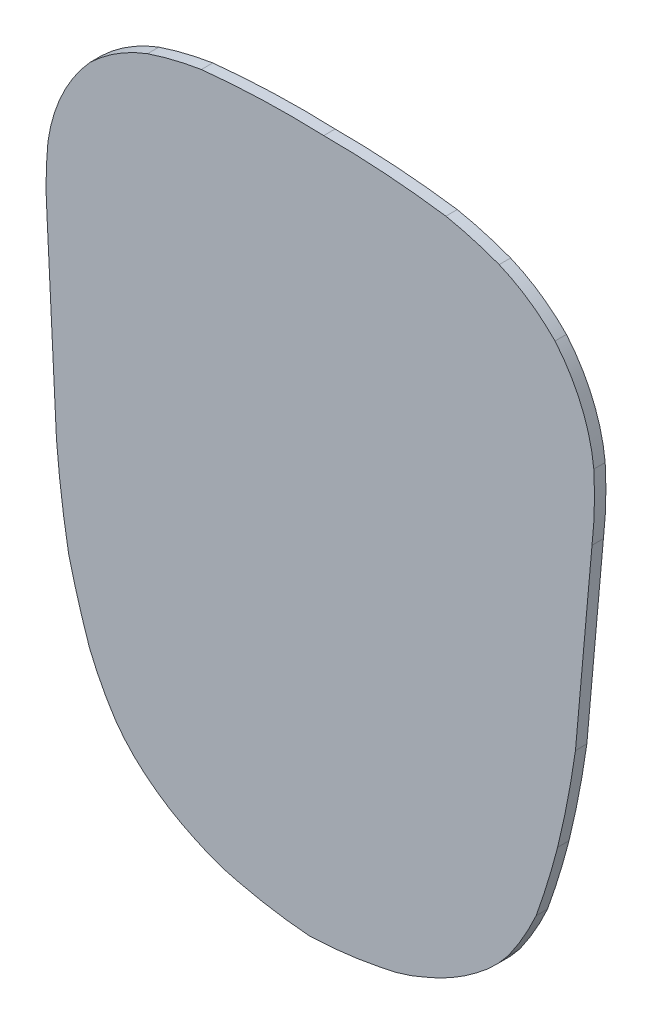
ISO-10303-21;
HEADER;
FILE_DESCRIPTION(('STEP AP214'),'2;1');
FILE_NAME('part.step','',(''),(''),'','','');
FILE_SCHEMA(('AUTOMOTIVE_DESIGN { 1 0 10303 214 1 1 1 1 }'));
ENDSEC;
DATA;
#1=APPLICATION_CONTEXT('core data for automotive mechanical design processes');
#2=APPLICATION_PROTOCOL_DEFINITION('international standard','automotive_design',2000,#1);
#3=PRODUCT_CONTEXT('',#1,'mechanical');
#4=PRODUCT('Part','Part','',(#3));
#5=PRODUCT_RELATED_PRODUCT_CATEGORY('part','',(#4));
#6=PRODUCT_DEFINITION_FORMATION('','',#4);
#7=PRODUCT_DEFINITION_CONTEXT('part definition',#1,'design');
#8=PRODUCT_DEFINITION('design','',#6,#7);
#9=PRODUCT_DEFINITION_SHAPE('','',#8);
#10=(LENGTH_UNIT() NAMED_UNIT(*) SI_UNIT(.MILLI.,.METRE.));
#11=(NAMED_UNIT(*) PLANE_ANGLE_UNIT() SI_UNIT($,.RADIAN.));
#12=(NAMED_UNIT(*) SI_UNIT($,.STERADIAN.) SOLID_ANGLE_UNIT());
#13=UNCERTAINTY_MEASURE_WITH_UNIT(LENGTH_MEASURE(1.E-05),#10,'distance_accuracy_value','');
#14=(GEOMETRIC_REPRESENTATION_CONTEXT(3) GLOBAL_UNCERTAINTY_ASSIGNED_CONTEXT((#13)) GLOBAL_UNIT_ASSIGNED_CONTEXT((#10,
#11,#12)) REPRESENTATION_CONTEXT('',''));
#15=CARTESIAN_POINT('',(0.,0.,0.));
#16=DIRECTION('',(0.,0.,1.));
#17=DIRECTION('',(1.,0.,0.));
#18=AXIS2_PLACEMENT_3D('',#15,#16,#17);
#19=CARTESIAN_POINT('',(-2.87645068487033,-22.2307778413904,43.1510965279302));
#20=DIRECTION('',(0.,0.,1.));
#21=DIRECTION('',(0.0193548335692301,0.999812677663925,0.));
#22=AXIS2_PLACEMENT_3D('',#19,#20,#21);
#23=PLANE('',#22);
#24=CARTESIAN_POINT('',(3.40605421210527,8.0200148488719,43.15109652793));
#25=DIRECTION('',(0.,0.,-1.));
#26=DIRECTION('',(-0.0193548335692301,-0.999812677663925,0.));
#27=AXIS2_PLACEMENT_3D('',#24,#25,#26);
#28=CIRCLE('',#27,7.43643173112);
#29=CARTESIAN_POINT('',(8.74976189327227,13.1916011731872,43.15109652793));
#30=VERTEX_POINT('',#29);
#31=CARTESIAN_POINT('',(6.29473617833653,14.8724621043842,43.1510965279299));
#32=VERTEX_POINT('',#31);
#33=EDGE_CURVE('E362',#30,#32,#28,.F.);
#34=ORIENTED_EDGE('',*,*,#33,.F.);
#35=CARTESIAN_POINT('',(3.11803650286176,8.43130453548574,43.1510965279299));
#36=DIRECTION('',(0.,0.,-1.));
#37=DIRECTION('',(-0.0193548335692301,-0.999812677663925,0.));
#38=AXIS2_PLACEMENT_3D('',#35,#36,#37);
#39=CIRCLE('',#38,7.3740595978);
#40=CARTESIAN_POINT('',(10.4553019723892,9.16702892789541,43.1510965279302));
#41=VERTEX_POINT('',#40);
#42=EDGE_CURVE('E208',#41,#30,#39,.F.);
#43=ORIENTED_EDGE('',*,*,#42,.F.);
#44=CARTESIAN_POINT('',(-6.32552371849111,8.14421174061843,43.1510965279296));
#45=DIRECTION('',(0.,0.,-1.));
#46=DIRECTION('',(-0.0193548335692301,-0.999812677663925,0.));
#47=AXIS2_PLACEMENT_3D('',#44,#45,#46);
#48=CIRCLE('',#47,16.81196793556);
#49=CARTESIAN_POINT('',(10.3766044314371,6.22557130278919,43.1510965279302));
#50=VERTEX_POINT('',#49);
#51=EDGE_CURVE('E35',#50,#41,#48,.F.);
#52=ORIENTED_EDGE('',*,*,#51,.F.);
#53=DIRECTION('',(-0.0886995040357044,-0.996058431008854,0.));
#54=VECTOR('',#53,1.);
#55=CARTESIAN_POINT('',(10.3766044314371,6.22557130278921,43.1510965279302));
#56=LINE('',#55,#54);
#57=CARTESIAN_POINT('',(9.64811099468465,-1.95510611475086,43.1510965279302));
#58=VERTEX_POINT('',#57);
#59=EDGE_CURVE('E207',#50,#58,#56,.T.);
#60=ORIENTED_EDGE('',*,*,#59,.T.);
#61=CARTESIAN_POINT('',(-31.2814474166913,3.80134354731974,43.1510965279289));
#62=DIRECTION('',(0.,0.,-1.));
#63=DIRECTION('',(-0.0193548335692301,-0.999812677663925,0.));
#64=AXIS2_PLACEMENT_3D('',#61,#62,#63);
#65=CIRCLE('',#64,41.33237791928);
#66=CARTESIAN_POINT('',(8.86403234955431,-6.0325732105216,43.1510965279303));
#67=VERTEX_POINT('',#66);
#68=EDGE_CURVE('E218',#67,#58,#65,.F.);
#69=ORIENTED_EDGE('',*,*,#68,.F.);
#70=CARTESIAN_POINT('',(-24.9737606237932,2.68335405814096,43.1510965279291));
#71=DIRECTION('',(0.,0.,-1.));
#72=DIRECTION('',(-0.0193548335692301,-0.999812677663925,0.));
#73=AXIS2_PLACEMENT_3D('',#70,#71,#72);
#74=CIRCLE('',#73,34.94228987144);
#75=CARTESIAN_POINT('',(7.9194767814797,-9.1064107597041,43.1510965279303));
#76=VERTEX_POINT('',#75);
#77=EDGE_CURVE('E302',#76,#67,#74,.F.);
#78=ORIENTED_EDGE('',*,*,#77,.F.);
#79=CARTESIAN_POINT('',(-3.58067037627316,-3.93497982202898,43.1510965279299));
#80=DIRECTION('',(0.,0.,-1.));
#81=DIRECTION('',(-0.0193548335692301,-0.999812677663925,0.));
#82=AXIS2_PLACEMENT_3D('',#79,#80,#81);
#83=CIRCLE('',#82,12.60940452968);
#84=CARTESIAN_POINT('',(6.69776683055133,-11.2391437836662,43.1510965279303));
#85=VERTEX_POINT('',#84);
#86=EDGE_CURVE('E305',#85,#76,#83,.F.);
#87=ORIENTED_EDGE('',*,*,#86,.F.);
#88=CARTESIAN_POINT('',(1.10266886694127,-6.86934474010801,43.15109652793));
#89=DIRECTION('',(0.,0.,-1.));
#90=DIRECTION('',(-0.0193548335692301,-0.999812677663925,0.));
#91=AXIS2_PLACEMENT_3D('',#88,#89,#90);
#92=CIRCLE('',#91,7.09931439672);
#93=CARTESIAN_POINT('',(5.3008399811585,-12.5943446701716,43.1510965279303));
#94=VERTEX_POINT('',#93);
#95=EDGE_CURVE('E308',#94,#85,#92,.F.);
#96=ORIENTED_EDGE('',*,*,#95,.F.);
#97=CARTESIAN_POINT('',(-0.638723059391969,-4.83953730632281,43.15109652793));
#98=DIRECTION('',(0.,0.,-1.));
#99=DIRECTION('',(-0.0193548335692301,-0.999812677663925,0.));
#100=AXIS2_PLACEMENT_3D('',#97,#98,#99);
#101=CIRCLE('',#100,9.76808304444);
#102=CARTESIAN_POINT('',(3.02325465351666,-13.8952187049386,43.1510965279302));
#103=VERTEX_POINT('',#102);
#104=EDGE_CURVE('E311',#103,#94,#101,.F.);
#105=ORIENTED_EDGE('',*,*,#104,.F.);
#106=CARTESIAN_POINT('',(-0.207770559998263,-6.83732878190931,43.15109652793));
#107=DIRECTION('',(0.,0.,-1.));
#108=DIRECTION('',(-0.0193548335692301,-0.999812677663925,0.));
#109=AXIS2_PLACEMENT_3D('',#106,#107,#108);
#110=CIRCLE('',#109,7.76230211316);
#111=CARTESIAN_POINT('',(1.11765382111094,-14.4856347581324,43.1510965279302));
#112=VERTEX_POINT('',#111);
#113=EDGE_CURVE('E314',#112,#103,#110,.F.);
#114=ORIENTED_EDGE('',*,*,#113,.F.);
#115=CARTESIAN_POINT('',(-2.80966912930602,4.75500909683415,43.1510965279298));
#116=DIRECTION('',(0.,0.,-1.));
#117=DIRECTION('',(-0.0193548335692301,-0.999812677663925,0.));
#118=AXIS2_PLACEMENT_3D('',#115,#116,#117);
#119=CIRCLE('',#118,19.6373684976);
#120=CARTESIAN_POINT('',(-2.0152683231092,-14.8662846645274,43.1510965279301));
#121=VERTEX_POINT('',#120);
#122=EDGE_CURVE('E317',#121,#112,#119,.F.);
#123=ORIENTED_EDGE('',*,*,#122,.F.);
#124=CARTESIAN_POINT('',(-0.523207579480698,4.71400533480683,43.1510965279299));
#125=DIRECTION('',(0.,0.,-1.));
#126=DIRECTION('',(-0.0193548335692301,-0.999812677663925,0.));
#127=AXIS2_PLACEMENT_3D('',#124,#125,#126);
#128=CIRCLE('',#127,19.63705684976);
#129=CARTESIAN_POINT('',(-5.17633782189568,-14.3637927736707,43.15109652793));
#130=VERTEX_POINT('',#129);
#131=EDGE_CURVE('E320',#130,#121,#128,.F.);
#132=ORIENTED_EDGE('',*,*,#131,.F.);
#133=CARTESIAN_POINT('',(-3.55589855490564,-6.77251418057686,43.1510965279299));
#134=DIRECTION('',(0.,0.,-1.));
#135=DIRECTION('',(-0.0193548335692301,-0.999812677663925,0.));
#136=AXIS2_PLACEMENT_3D('',#133,#134,#135);
#137=CIRCLE('',#136,7.76230211316);
#138=CARTESIAN_POINT('',(-7.05766041396093,-13.7000677154428,43.1510965279299));
#139=VERTEX_POINT('',#138);
#140=EDGE_CURVE('E323',#139,#130,#137,.F.);
#141=ORIENTED_EDGE('',*,*,#140,.F.);
#142=CARTESIAN_POINT('',(-3.04794957670783,-4.79289839153911,43.1510965279299));
#143=DIRECTION('',(0.,0.,-1.));
#144=DIRECTION('',(-0.0193548335692301,-0.999812677663925,0.));
#145=AXIS2_PLACEMENT_3D('',#142,#143,#144);
#146=CIRCLE('',#145,9.76808304444);
#147=CARTESIAN_POINT('',(-9.28319236302841,-12.3120202657152,43.1510965279298));
#148=VERTEX_POINT('',#147);
#149=EDGE_CURVE('E326',#148,#139,#146,.F.);
#150=ORIENTED_EDGE('',*,*,#149,.F.);
#151=CARTESIAN_POINT('',(-4.76167465689602,-6.83879977530856,43.1510965279299));
#152=DIRECTION('',(0.,0.,-1.));
#153=DIRECTION('',(-0.0193548335692301,-0.999812677663925,0.));
#154=AXIS2_PLACEMENT_3D('',#151,#152,#153);
#155=CIRCLE('',#154,7.09931439672);
#156=CARTESIAN_POINT('',(-10.5813963887555,-10.9046457963967,43.1510965279297));
#157=VERTEX_POINT('',#156);
#158=EDGE_CURVE('E329',#157,#148,#155,.F.);
#159=ORIENTED_EDGE('',*,*,#158,.F.);
#160=CARTESIAN_POINT('',(-0.0279711922389993,-4.00375460651079,43.15109652793));
#161=DIRECTION('',(0.,0.,-1.));
#162=DIRECTION('',(-0.0193548335692301,-0.999812677663925,0.));
#163=AXIS2_PLACEMENT_3D('',#160,#161,#162);
#164=CIRCLE('',#163,12.60940452968);
#165=CARTESIAN_POINT('',(-11.7196490905641,-8.726227530195,43.1510965279297));
#166=VERTEX_POINT('',#165);
#167=EDGE_CURVE('E332',#166,#157,#164,.F.);
#168=ORIENTED_EDGE('',*,*,#167,.F.);
#169=CARTESIAN_POINT('',(21.3074102324665,2.68328490166436,43.1510965279306));
#170=DIRECTION('',(0.,0.,-1.));
#171=DIRECTION('',(-0.0193548335692301,-0.999812677663925,0.));
#172=AXIS2_PLACEMENT_3D('',#169,#170,#171);
#173=CIRCLE('',#172,34.94228987144);
#174=CARTESIAN_POINT('',(-12.6348799299237,-5.61638738053107,43.1510965279296));
#175=VERTEX_POINT('',#174);
#176=EDGE_CURVE('E335',#175,#166,#173,.F.);
#177=ORIENTED_EDGE('',*,*,#176,.F.);
#178=CARTESIAN_POINT('',(28.0310735031442,1.7758853310058,43.1510965279308));
#179=DIRECTION('',(0.,0.,-1.));
#180=DIRECTION('',(-0.0193548335692301,-0.999812677663925,0.));
#181=AXIS2_PLACEMENT_3D('',#178,#179,#180);
#182=CIRCLE('',#181,41.33237791928);
#183=CARTESIAN_POINT('',(-13.1702154109104,-1.51337845938613,43.1510965279295));
#184=VERTEX_POINT('',#183);
#185=EDGE_CURVE('E338',#184,#175,#182,.F.);
#186=ORIENTED_EDGE('',*,*,#185,.F.);
#187=DIRECTION('',(-0.0500831809567766,0.998745050042928,0.));
#188=VECTOR('',#187,1.);
#189=CARTESIAN_POINT('',(-13.1702154109104,-1.51337845938573,43.1510965279295));
#190=LINE('',#189,#188);
#191=CARTESIAN_POINT('',(-13.5815510662261,6.68936429385884,43.1510965279294));
#192=VERTEX_POINT('',#191);
#193=EDGE_CURVE('E226',#184,#192,#190,.T.);
#194=ORIENTED_EDGE('',*,*,#193,.T.);
#195=CARTESIAN_POINT('',(3.18231954948565,7.96015453853935,43.1510965279299));
#196=DIRECTION('',(0.,0.,-1.));
#197=DIRECTION('',(-0.0193548335692301,-0.999812677663925,0.));
#198=AXIS2_PLACEMENT_3D('',#195,#196,#197);
#199=CIRCLE('',#198,16.81196793556);
#200=CARTESIAN_POINT('',(-13.5463481289567,9.63166390750378,43.1510965279294));
#201=VERTEX_POINT('',#200);
#202=EDGE_CURVE('E229',#201,#192,#199,.F.);
#203=ORIENTED_EDGE('',*,*,#202,.F.);
#204=CARTESIAN_POINT('',(-6.24305419079957,8.61252083374835,43.1510965279296));
#205=DIRECTION('',(0.,0.,-1.));
#206=DIRECTION('',(-0.0193548335692301,-0.999812677663925,0.));
#207=AXIS2_PLACEMENT_3D('',#204,#205,#206);
#208=CIRCLE('',#207,7.3740595978);
#209=CARTESIAN_POINT('',(-11.6863252040828,13.5872123445716,43.1510965279294));
#210=VERTEX_POINT('',#209);
#211=EDGE_CURVE('E344',#210,#201,#208,.F.);
#212=ORIENTED_EDGE('',*,*,#211,.F.);
#213=CARTESIAN_POINT('',(-6.54677401618405,8.21268627443511,43.1510965279296));
#214=DIRECTION('',(0.,0.,-1.));
#215=DIRECTION('',(-0.0193548335692301,-0.999812677663925,0.));
#216=AXIS2_PLACEMENT_3D('',#213,#214,#215);
#217=CIRCLE('',#216,7.43643173112);
#218=CARTESIAN_POINT('',(-9.16808546254474,15.17179851615,43.1510965279294));
#219=VERTEX_POINT('',#218);
#220=EDGE_CURVE('E347',#219,#210,#217,.F.);
#221=ORIENTED_EDGE('',*,*,#220,.F.);
#222=CARTESIAN_POINT('',(-4.43670572158524,1.02428534892838,43.1510965279298));
#223=DIRECTION('',(0.,0.,-1.));
#224=DIRECTION('',(-0.0193548335692301,-0.999812677663925,0.));
#225=AXIS2_PLACEMENT_3D('',#222,#223,#224);
#226=CIRCLE('',#225,14.91771038296);
#227=CARTESIAN_POINT('',(-6.80003650135285,15.7536013783737,43.1510965279295));
#228=VERTEX_POINT('',#227);
#229=EDGE_CURVE('E350',#228,#219,#226,.F.);
#230=ORIENTED_EDGE('',*,*,#229,.F.);
#231=CARTESIAN_POINT('',(-2.87645068487033,-22.2307778413904,43.1510965279302));
#232=DIRECTION('',(0.,0.,-1.));
#233=DIRECTION('',(-0.0193548335692301,-0.999812677663925,0.));
#234=AXIS2_PLACEMENT_3D('',#231,#232,#233);
#235=CIRCLE('',#234,38.18648439396);
#236=CARTESIAN_POINT('',(-1.41914055333825,15.9278887698879,43.1510965279297));
#237=VERTEX_POINT('',#236);
#238=EDGE_CURVE('E353',#237,#228,#235,.F.);
#239=ORIENTED_EDGE('',*,*,#238,.F.);
#240=CARTESIAN_POINT('',(-1.43975485684221,-22.2585901013477,43.1510965279302));
#241=DIRECTION('',(0.,0.,-1.));
#242=DIRECTION('',(-0.0193548335692301,-0.999812677663925,0.));
#243=AXIS2_PLACEMENT_3D('',#240,#241,#242);
#244=CIRCLE('',#243,38.186484435371);
#245=CARTESIAN_POINT('',(3.95097858118645,15.5454782846469,43.1510965279299));
#246=VERTEX_POINT('',#245);
#247=EDGE_CURVE('E356',#246,#237,#244,.F.);
#248=ORIENTED_EDGE('',*,*,#247,.F.);
#249=CARTESIAN_POINT('',(1.019358338455,0.918664351931352,43.15109652793));
#250=DIRECTION('',(0.,0.,-1.));
#251=DIRECTION('',(-0.0193548335692301,-0.999812677663925,0.));
#252=AXIS2_PLACEMENT_3D('',#249,#250,#251);
#253=CIRCLE('',#252,14.91771038296);
#254=EDGE_CURVE('E359',#32,#246,#253,.F.);
#255=ORIENTED_EDGE('',*,*,#254,.F.);
#256=EDGE_LOOP('',(#34,#43,#52,#60,#69,#78,#87,#96,#105,#114,#123,#132,#141,#150,#159,#168,#177,
#186,#194,#203,#212,#221,#230,#239,#248,#255));
#257=FACE_BOUND('',#256,.T.);
#258=ADVANCED_FACE('F32',(#257),#23,.F.);
#259=CARTESIAN_POINT('',(-6.32552371849112,8.14421174061844,43.5320965279296));
#260=DIRECTION('',(0.,0.,-1.));
#261=DIRECTION('',(-0.0193548335692301,-0.999812677663925,0.));
#262=AXIS2_PLACEMENT_3D('',#259,#260,#261);
#263=CYLINDRICAL_SURFACE('',#262,16.81196793556);
#264=DIRECTION('',(0.,0.,-1.));
#265=VECTOR('',#264,1.);
#266=CARTESIAN_POINT('',(10.4553019723892,9.16702892789546,43.5320965279302));
#267=LINE('',#266,#265);
#268=CARTESIAN_POINT('',(10.4553019723892,9.16702892789545,43.6520965279302));
#269=VERTEX_POINT('',#268);
#270=EDGE_CURVE('E211',#269,#41,#267,.T.);
#271=ORIENTED_EDGE('',*,*,#270,.F.);
#272=CARTESIAN_POINT('',(-6.32552371849113,8.14421174061844,43.6520965279296));
#273=DIRECTION('',(0.,0.,-1.));
#274=DIRECTION('',(-0.0193548335692301,-0.999812677663925,0.));
#275=AXIS2_PLACEMENT_3D('',#272,#273,#274);
#276=CIRCLE('',#275,16.81196793556);
#277=CARTESIAN_POINT('',(10.3766044314371,6.22557130278932,43.6520965279302));
#278=VERTEX_POINT('',#277);
#279=EDGE_CURVE('E216',#278,#269,#276,.F.);
#280=ORIENTED_EDGE('',*,*,#279,.F.);
#281=DIRECTION('',(0.,0.,1.));
#282=VECTOR('',#281,1.);
#283=CARTESIAN_POINT('',(10.3766044314371,6.22557130278923,43.5320965279302));
#284=LINE('',#283,#282);
#285=EDGE_CURVE('E213',#278,#50,#284,.F.);
#286=ORIENTED_EDGE('',*,*,#285,.T.);
#287=ORIENTED_EDGE('',*,*,#51,.T.);
#288=EDGE_LOOP('',(#271,#280,#286,#287));
#289=FACE_BOUND('',#288,.T.);
#290=ADVANCED_FACE('F214',(#289),#263,.T.);
#291=CARTESIAN_POINT('',(3.11803650286175,8.43130453548575,43.5320965279299));
#292=DIRECTION('',(0.,0.,-1.));
#293=DIRECTION('',(-0.0193548335692301,-0.999812677663925,0.));
#294=AXIS2_PLACEMENT_3D('',#291,#292,#293);
#295=CYLINDRICAL_SURFACE('',#294,7.3740595978);
#296=DIRECTION('',(0.,0.,-1.));
#297=VECTOR('',#296,1.);
#298=CARTESIAN_POINT('',(8.74976189327226,13.1916011731872,43.53209652793));
#299=LINE('',#298,#297);
#300=CARTESIAN_POINT('',(8.74976189327226,13.1916011731872,43.65209652793));
#301=VERTEX_POINT('',#300);
#302=EDGE_CURVE('E363',#301,#30,#299,.T.);
#303=ORIENTED_EDGE('',*,*,#302,.F.);
#304=CARTESIAN_POINT('',(3.11803650286175,8.43130453548575,43.6520965279299));
#305=DIRECTION('',(0.,0.,-1.));
#306=DIRECTION('',(-0.0193548335692301,-0.999812677663925,0.));
#307=AXIS2_PLACEMENT_3D('',#304,#305,#306);
#308=CIRCLE('',#307,7.3740595978);
#309=EDGE_CURVE('E296',#269,#301,#308,.F.);
#310=ORIENTED_EDGE('',*,*,#309,.F.);
#311=ORIENTED_EDGE('',*,*,#270,.T.);
#312=ORIENTED_EDGE('',*,*,#42,.T.);
#313=EDGE_LOOP('',(#303,#310,#311,#312));
#314=FACE_BOUND('',#313,.T.);
#315=ADVANCED_FACE('F367',(#314),#295,.T.);
#316=CARTESIAN_POINT('',(3.40605421210526,8.02001484887191,43.53209652793));
#317=DIRECTION('',(0.,0.,-1.));
#318=DIRECTION('',(-0.0193548335692301,-0.999812677663925,0.));
#319=AXIS2_PLACEMENT_3D('',#316,#317,#318);
#320=CYLINDRICAL_SURFACE('',#319,7.43643173112);
#321=DIRECTION('',(0.,0.,-1.));
#322=VECTOR('',#321,1.);
#323=CARTESIAN_POINT('',(6.29473617833652,14.8724621043842,43.5320965279299));
#324=LINE('',#323,#322);
#325=CARTESIAN_POINT('',(6.29473617833651,14.8724621043842,43.6520965279299));
#326=VERTEX_POINT('',#325);
#327=EDGE_CURVE('E361',#326,#32,#324,.T.);
#328=ORIENTED_EDGE('',*,*,#327,.F.);
#329=CARTESIAN_POINT('',(3.40605421210526,8.02001484887191,43.6520965279299));
#330=DIRECTION('',(0.,0.,-1.));
#331=DIRECTION('',(-0.0193548335692301,-0.999812677663925,0.));
#332=AXIS2_PLACEMENT_3D('',#329,#330,#331);
#333=CIRCLE('',#332,7.43643173112);
#334=EDGE_CURVE('E293',#301,#326,#333,.F.);
#335=ORIENTED_EDGE('',*,*,#334,.F.);
#336=ORIENTED_EDGE('',*,*,#302,.T.);
#337=ORIENTED_EDGE('',*,*,#33,.T.);
#338=EDGE_LOOP('',(#328,#335,#336,#337));
#339=FACE_BOUND('',#338,.T.);
#340=ADVANCED_FACE('F423',(#339),#320,.T.);
#341=CARTESIAN_POINT('',(1.01935833845499,0.918664351931359,43.53209652793));
#342=DIRECTION('',(0.,0.,-1.));
#343=DIRECTION('',(-0.0193548335692301,-0.999812677663925,0.));
#344=AXIS2_PLACEMENT_3D('',#341,#342,#343);
#345=CYLINDRICAL_SURFACE('',#344,14.91771038296);
#346=DIRECTION('',(0.,0.,-1.));
#347=VECTOR('',#346,1.);
#348=CARTESIAN_POINT('',(3.95097858118647,15.5454782846469,43.5320965279299));
#349=LINE('',#348,#347);
#350=CARTESIAN_POINT('',(3.95097858118645,15.5454782846469,43.6520965279299));
#351=VERTEX_POINT('',#350);
#352=EDGE_CURVE('E358',#351,#246,#349,.T.);
#353=ORIENTED_EDGE('',*,*,#352,.F.);
#354=CARTESIAN_POINT('',(1.01935833845498,0.91866435193136,43.6520965279299));
#355=DIRECTION('',(0.,0.,-1.));
#356=DIRECTION('',(-0.0193548335692301,-0.999812677663925,0.));
#357=AXIS2_PLACEMENT_3D('',#354,#355,#356);
#358=CIRCLE('',#357,14.91771038296);
#359=EDGE_CURVE('E290',#326,#351,#358,.F.);
#360=ORIENTED_EDGE('',*,*,#359,.F.);
#361=ORIENTED_EDGE('',*,*,#327,.T.);
#362=ORIENTED_EDGE('',*,*,#254,.T.);
#363=EDGE_LOOP('',(#353,#360,#361,#362));
#364=FACE_BOUND('',#363,.T.);
#365=ADVANCED_FACE('F419',(#364),#345,.T.);
#366=CARTESIAN_POINT('',(-1.43975485684222,-22.2585901013477,43.5320965279302));
#367=DIRECTION('',(0.,0.,-1.));
#368=DIRECTION('',(-0.0193548335692301,-0.999812677663925,0.));
#369=AXIS2_PLACEMENT_3D('',#366,#367,#368);
#370=CYLINDRICAL_SURFACE('',#369,38.186484435371);
#371=DIRECTION('',(0.,0.,-1.));
#372=VECTOR('',#371,1.);
#373=CARTESIAN_POINT('',(-1.41914055333816,15.9278887698879,43.5320965279297));
#374=LINE('',#373,#372);
#375=CARTESIAN_POINT('',(-1.41914055333827,15.9278887698879,43.6520965279297));
#376=VERTEX_POINT('',#375);
#377=EDGE_CURVE('E355',#376,#237,#374,.T.);
#378=ORIENTED_EDGE('',*,*,#377,.F.);
#379=CARTESIAN_POINT('',(-1.43975485684222,-22.2585901013477,43.6520965279302));
#380=DIRECTION('',(0.,0.,-1.));
#381=DIRECTION('',(-0.0193548335692301,-0.999812677663925,0.));
#382=AXIS2_PLACEMENT_3D('',#379,#380,#381);
#383=CIRCLE('',#382,38.186484435371);
#384=EDGE_CURVE('E287',#351,#376,#383,.F.);
#385=ORIENTED_EDGE('',*,*,#384,.F.);
#386=ORIENTED_EDGE('',*,*,#352,.T.);
#387=ORIENTED_EDGE('',*,*,#247,.T.);
#388=EDGE_LOOP('',(#378,#385,#386,#387));
#389=FACE_BOUND('',#388,.T.);
#390=ADVANCED_FACE('F428',(#389),#370,.T.);
#391=CARTESIAN_POINT('',(-2.87645068487034,-22.2307778413904,43.5320965279302));
#392=DIRECTION('',(0.,0.,-1.));
#393=DIRECTION('',(-0.0193548335692301,-0.999812677663925,0.));
#394=AXIS2_PLACEMENT_3D('',#391,#392,#393);
#395=CYLINDRICAL_SURFACE('',#394,38.18648439396);
#396=DIRECTION('',(0.,0.,-1.));
#397=VECTOR('',#396,1.);
#398=CARTESIAN_POINT('',(-6.80003650135287,15.7536013783737,43.5320965279295));
#399=LINE('',#398,#397);
#400=CARTESIAN_POINT('',(-6.80003650135289,15.7536013783737,43.6520965279295));
#401=VERTEX_POINT('',#400);
#402=EDGE_CURVE('E352',#401,#228,#399,.T.);
#403=ORIENTED_EDGE('',*,*,#402,.F.);
#404=CARTESIAN_POINT('',(-2.87645068487035,-22.2307778413904,43.6520965279302));
#405=DIRECTION('',(0.,0.,-1.));
#406=DIRECTION('',(-0.0193548335692301,-0.999812677663925,0.));
#407=AXIS2_PLACEMENT_3D('',#404,#405,#406);
#408=CIRCLE('',#407,38.18648439396);
#409=EDGE_CURVE('E284',#376,#401,#408,.F.);
#410=ORIENTED_EDGE('',*,*,#409,.F.);
#411=ORIENTED_EDGE('',*,*,#377,.T.);
#412=ORIENTED_EDGE('',*,*,#238,.T.);
#413=EDGE_LOOP('',(#403,#410,#411,#412));
#414=FACE_BOUND('',#413,.T.);
#415=ADVANCED_FACE('F432',(#414),#395,.T.);
#416=CARTESIAN_POINT('',(-4.43670572158525,1.02428534892838,43.5320965279298));
#417=DIRECTION('',(0.,0.,-1.));
#418=DIRECTION('',(-0.0193548335692301,-0.999812677663925,0.));
#419=AXIS2_PLACEMENT_3D('',#416,#417,#418);
#420=CYLINDRICAL_SURFACE('',#419,14.91771038296);
#421=DIRECTION('',(0.,0.,-1.));
#422=VECTOR('',#421,1.);
#423=CARTESIAN_POINT('',(-9.16808546254472,15.17179851615,43.5320965279294));
#424=LINE('',#423,#422);
#425=CARTESIAN_POINT('',(-9.16808546254475,15.17179851615,43.6520965279295));
#426=VERTEX_POINT('',#425);
#427=EDGE_CURVE('E349',#426,#219,#424,.T.);
#428=ORIENTED_EDGE('',*,*,#427,.F.);
#429=CARTESIAN_POINT('',(-4.43670572158526,1.02428534892839,43.6520965279298));
#430=DIRECTION('',(0.,0.,-1.));
#431=DIRECTION('',(-0.0193548335692301,-0.999812677663925,0.));
#432=AXIS2_PLACEMENT_3D('',#429,#430,#431);
#433=CIRCLE('',#432,14.91771038296);
#434=EDGE_CURVE('E281',#401,#426,#433,.F.);
#435=ORIENTED_EDGE('',*,*,#434,.F.);
#436=ORIENTED_EDGE('',*,*,#402,.T.);
#437=ORIENTED_EDGE('',*,*,#229,.T.);
#438=EDGE_LOOP('',(#428,#435,#436,#437));
#439=FACE_BOUND('',#438,.T.);
#440=ADVANCED_FACE('F434',(#439),#420,.T.);
#441=CARTESIAN_POINT('',(-6.54677401618406,8.21268627443511,43.5320965279296));
#442=DIRECTION('',(0.,0.,-1.));
#443=DIRECTION('',(-0.0193548335692301,-0.999812677663925,0.));
#444=AXIS2_PLACEMENT_3D('',#441,#442,#443);
#445=CYLINDRICAL_SURFACE('',#444,7.43643173112);
#446=DIRECTION('',(0.,0.,-1.));
#447=VECTOR('',#446,1.);
#448=CARTESIAN_POINT('',(-11.6863252040828,13.5872123445716,43.5320965279294));
#449=LINE('',#448,#447);
#450=CARTESIAN_POINT('',(-11.6863252040828,13.5872123445716,43.6520965279294));
#451=VERTEX_POINT('',#450);
#452=EDGE_CURVE('E346',#451,#210,#449,.T.);
#453=ORIENTED_EDGE('',*,*,#452,.F.);
#454=CARTESIAN_POINT('',(-6.54677401618406,8.21268627443511,43.6520965279296));
#455=DIRECTION('',(0.,0.,-1.));
#456=DIRECTION('',(-0.0193548335692301,-0.999812677663925,0.));
#457=AXIS2_PLACEMENT_3D('',#454,#455,#456);
#458=CIRCLE('',#457,7.43643173112);
#459=EDGE_CURVE('E278',#426,#451,#458,.F.);
#460=ORIENTED_EDGE('',*,*,#459,.F.);
#461=ORIENTED_EDGE('',*,*,#427,.T.);
#462=ORIENTED_EDGE('',*,*,#220,.T.);
#463=EDGE_LOOP('',(#453,#460,#461,#462));
#464=FACE_BOUND('',#463,.T.);
#465=ADVANCED_FACE('F438',(#464),#445,.T.);
#466=CARTESIAN_POINT('',(-6.24305419079959,8.61252083374836,43.5320965279296));
#467=DIRECTION('',(0.,0.,-1.));
#468=DIRECTION('',(-0.0193548335692301,-0.999812677663925,0.));
#469=AXIS2_PLACEMENT_3D('',#466,#467,#468);
#470=CYLINDRICAL_SURFACE('',#469,7.3740595978);
#471=DIRECTION('',(0.,0.,-1.));
#472=VECTOR('',#471,1.);
#473=CARTESIAN_POINT('',(-13.5463481289567,9.63166390750379,43.5320965279294));
#474=LINE('',#473,#472);
#475=CARTESIAN_POINT('',(-13.5463481289567,9.63166390750378,43.6520965279294));
#476=VERTEX_POINT('',#475);
#477=EDGE_CURVE('E343',#476,#201,#474,.T.);
#478=ORIENTED_EDGE('',*,*,#477,.F.);
#479=CARTESIAN_POINT('',(-6.24305419079959,8.61252083374836,43.6520965279296));
#480=DIRECTION('',(0.,0.,-1.));
#481=DIRECTION('',(-0.0193548335692301,-0.999812677663925,0.));
#482=AXIS2_PLACEMENT_3D('',#479,#480,#481);
#483=CIRCLE('',#482,7.3740595978);
#484=EDGE_CURVE('E275',#451,#476,#483,.F.);
#485=ORIENTED_EDGE('',*,*,#484,.F.);
#486=ORIENTED_EDGE('',*,*,#452,.T.);
#487=ORIENTED_EDGE('',*,*,#211,.T.);
#488=EDGE_LOOP('',(#478,#485,#486,#487));
#489=FACE_BOUND('',#488,.T.);
#490=ADVANCED_FACE('F443',(#489),#470,.T.);
#491=CARTESIAN_POINT('',(3.18231954948564,7.96015453853935,43.5320965279299));
#492=DIRECTION('',(0.,0.,-1.));
#493=DIRECTION('',(-0.0193548335692301,-0.999812677663925,0.));
#494=AXIS2_PLACEMENT_3D('',#491,#492,#493);
#495=CYLINDRICAL_SURFACE('',#494,16.81196793556);
#496=DIRECTION('',(0.,0.,1.));
#497=VECTOR('',#496,1.);
#498=CARTESIAN_POINT('',(-13.5815510662261,6.68936429385887,43.5320965279294));
#499=LINE('',#498,#497);
#500=CARTESIAN_POINT('',(-13.5815510662261,6.68936429385886,43.6520965279294));
#501=VERTEX_POINT('',#500);
#502=EDGE_CURVE('E228',#192,#501,#499,.T.);
#503=ORIENTED_EDGE('',*,*,#502,.T.);
#504=CARTESIAN_POINT('',(3.18231954948563,7.96015453853936,43.6520965279299));
#505=DIRECTION('',(0.,0.,-1.));
#506=DIRECTION('',(-0.0193548335692301,-0.999812677663925,0.));
#507=AXIS2_PLACEMENT_3D('',#504,#505,#506);
#508=CIRCLE('',#507,16.81196793556);
#509=EDGE_CURVE('E272',#476,#501,#508,.F.);
#510=ORIENTED_EDGE('',*,*,#509,.F.);
#511=ORIENTED_EDGE('',*,*,#477,.T.);
#512=ORIENTED_EDGE('',*,*,#202,.T.);
#513=EDGE_LOOP('',(#503,#510,#511,#512));
#514=FACE_BOUND('',#513,.T.);
#515=ADVANCED_FACE('F447',(#514),#495,.T.);
#516=CARTESIAN_POINT('',(-13.1702154109105,-1.51337845938573,43.5320965279295));
#517=DIRECTION('',(0.998745050042928,0.0500831809567766,0.));
#518=DIRECTION('',(-0.0500831809567766,0.998745050042928,0.));
#519=AXIS2_PLACEMENT_3D('',#516,#517,#518);
#520=PLANE('',#519);
#521=ORIENTED_EDGE('',*,*,#502,.F.);
#522=ORIENTED_EDGE('',*,*,#193,.F.);
#523=DIRECTION('',(0.,0.,-1.));
#524=VECTOR('',#523,1.);
#525=CARTESIAN_POINT('',(-13.1702154109104,-1.51337845938593,43.5320965279295));
#526=LINE('',#525,#524);
#527=CARTESIAN_POINT('',(-13.1702154109104,-1.51337845938599,43.6520965279296));
#528=VERTEX_POINT('',#527);
#529=EDGE_CURVE('E340',#528,#184,#526,.T.);
#530=ORIENTED_EDGE('',*,*,#529,.F.);
#531=DIRECTION('',(0.050083180956776,-0.998745050042928,0.));
#532=VECTOR('',#531,1.);
#533=CARTESIAN_POINT('',(-13.5815510662261,6.68936429385881,43.6520965279294));
#534=LINE('',#533,#532);
#535=EDGE_CURVE('E271',#501,#528,#534,.T.);
#536=ORIENTED_EDGE('',*,*,#535,.F.);
#537=EDGE_LOOP('',(#521,#522,#530,#536));
#538=FACE_BOUND('',#537,.T.);
#539=ADVANCED_FACE('F451',(#538),#520,.F.);
#540=CARTESIAN_POINT('',(28.0310735031442,1.77588533100581,43.5320965279308));
#541=DIRECTION('',(0.,0.,-1.));
#542=DIRECTION('',(-0.0193548335692301,-0.999812677663925,0.));
#543=AXIS2_PLACEMENT_3D('',#540,#541,#542);
#544=CYLINDRICAL_SURFACE('',#543,41.33237791928);
#545=DIRECTION('',(0.,0.,-1.));
#546=VECTOR('',#545,1.);
#547=CARTESIAN_POINT('',(-12.6348799299237,-5.61638738053115,43.5320965279296));
#548=LINE('',#547,#546);
#549=CARTESIAN_POINT('',(-12.6348799299238,-5.61638738053106,43.6520965279296));
#550=VERTEX_POINT('',#549);
#551=EDGE_CURVE('E337',#550,#175,#548,.T.);
#552=ORIENTED_EDGE('',*,*,#551,.F.);
#553=CARTESIAN_POINT('',(28.0310735031442,1.77588533100581,43.6520965279308));
#554=DIRECTION('',(0.,0.,-1.));
#555=DIRECTION('',(-0.0193548335692301,-0.999812677663925,0.));
#556=AXIS2_PLACEMENT_3D('',#553,#554,#555);
#557=CIRCLE('',#556,41.33237791928);
#558=EDGE_CURVE('E268',#528,#550,#557,.F.);
#559=ORIENTED_EDGE('',*,*,#558,.F.);
#560=ORIENTED_EDGE('',*,*,#529,.T.);
#561=ORIENTED_EDGE('',*,*,#185,.T.);
#562=EDGE_LOOP('',(#552,#559,#560,#561));
#563=FACE_BOUND('',#562,.T.);
#564=ADVANCED_FACE('F456',(#563),#544,.T.);
#565=CARTESIAN_POINT('',(21.3074102324665,2.68328490166436,43.5320965279306));
#566=DIRECTION('',(0.,0.,-1.));
#567=DIRECTION('',(-0.0193548335692301,-0.999812677663925,0.));
#568=AXIS2_PLACEMENT_3D('',#565,#566,#567);
#569=CYLINDRICAL_SURFACE('',#568,34.94228987144);
#570=DIRECTION('',(0.,0.,-1.));
#571=VECTOR('',#570,1.);
#572=CARTESIAN_POINT('',(-11.7196490905641,-8.72622753019495,43.5320965279297));
#573=LINE('',#572,#571);
#574=CARTESIAN_POINT('',(-11.7196490905641,-8.72622753019496,43.6520965279297));
#575=VERTEX_POINT('',#574);
#576=EDGE_CURVE('E334',#575,#166,#573,.T.);
#577=ORIENTED_EDGE('',*,*,#576,.F.);
#578=CARTESIAN_POINT('',(21.3074102324665,2.68328490166437,43.6520965279306));
#579=DIRECTION('',(0.,0.,-1.));
#580=DIRECTION('',(-0.0193548335692301,-0.999812677663925,0.));
#581=AXIS2_PLACEMENT_3D('',#578,#579,#580);
#582=CIRCLE('',#581,34.94228987144);
#583=EDGE_CURVE('E265',#550,#575,#582,.F.);
#584=ORIENTED_EDGE('',*,*,#583,.F.);
#585=ORIENTED_EDGE('',*,*,#551,.T.);
#586=ORIENTED_EDGE('',*,*,#176,.T.);
#587=EDGE_LOOP('',(#577,#584,#585,#586));
#588=FACE_BOUND('',#587,.T.);
#589=ADVANCED_FACE('F460',(#588),#569,.T.);
#590=CARTESIAN_POINT('',(-0.0279711922390115,-4.00375460651078,43.53209652793));
#591=DIRECTION('',(0.,0.,-1.));
#592=DIRECTION('',(-0.0193548335692301,-0.999812677663925,0.));
#593=AXIS2_PLACEMENT_3D('',#590,#591,#592);
#594=CYLINDRICAL_SURFACE('',#593,12.60940452968);
#595=DIRECTION('',(0.,0.,-1.));
#596=VECTOR('',#595,1.);
#597=CARTESIAN_POINT('',(-10.5813963887555,-10.9046457963967,43.5320965279297));
#598=LINE('',#597,#596);
#599=CARTESIAN_POINT('',(-10.5813963887555,-10.9046457963967,43.6520965279297));
#600=VERTEX_POINT('',#599);
#601=EDGE_CURVE('E331',#600,#157,#598,.T.);
#602=ORIENTED_EDGE('',*,*,#601,.F.);
#603=CARTESIAN_POINT('',(-0.0279711922390154,-4.00375460651078,43.65209652793));
#604=DIRECTION('',(0.,0.,-1.));
#605=DIRECTION('',(-0.0193548335692301,-0.999812677663925,0.));
#606=AXIS2_PLACEMENT_3D('',#603,#604,#605);
#607=CIRCLE('',#606,12.60940452968);
#608=EDGE_CURVE('E262',#575,#600,#607,.F.);
#609=ORIENTED_EDGE('',*,*,#608,.F.);
#610=ORIENTED_EDGE('',*,*,#576,.T.);
#611=ORIENTED_EDGE('',*,*,#167,.T.);
#612=EDGE_LOOP('',(#602,#609,#610,#611));
#613=FACE_BOUND('',#612,.T.);
#614=ADVANCED_FACE('F464',(#613),#594,.T.);
#615=CARTESIAN_POINT('',(-4.76167465689604,-6.83879977530855,43.5320965279299));
#616=DIRECTION('',(0.,0.,-1.));
#617=DIRECTION('',(-0.0193548335692301,-0.999812677663925,0.));
#618=AXIS2_PLACEMENT_3D('',#615,#616,#617);
#619=CYLINDRICAL_SURFACE('',#618,7.09931439672);
#620=DIRECTION('',(0.,0.,-1.));
#621=VECTOR('',#620,1.);
#622=CARTESIAN_POINT('',(-9.28319236302909,-12.3120202657146,43.5320965279298));
#623=LINE('',#622,#621);
#624=CARTESIAN_POINT('',(-9.28319236302837,-12.3120202657152,43.6520965279298));
#625=VERTEX_POINT('',#624);
#626=EDGE_CURVE('E328',#625,#148,#623,.T.);
#627=ORIENTED_EDGE('',*,*,#626,.F.);
#628=CARTESIAN_POINT('',(-4.76167465689604,-6.83879977530855,43.6520965279299));
#629=DIRECTION('',(0.,0.,-1.));
#630=DIRECTION('',(-0.0193548335692301,-0.999812677663925,0.));
#631=AXIS2_PLACEMENT_3D('',#628,#629,#630);
#632=CIRCLE('',#631,7.09931439672);
#633=EDGE_CURVE('E259',#600,#625,#632,.F.);
#634=ORIENTED_EDGE('',*,*,#633,.F.);
#635=ORIENTED_EDGE('',*,*,#601,.T.);
#636=ORIENTED_EDGE('',*,*,#158,.T.);
#637=EDGE_LOOP('',(#627,#634,#635,#636));
#638=FACE_BOUND('',#637,.T.);
#639=ADVANCED_FACE('F468',(#638),#619,.T.);
#640=CARTESIAN_POINT('',(-3.04794957670783,-4.79289839153911,43.5320965279299));
#641=DIRECTION('',(0.,0.,-1.));
#642=DIRECTION('',(-0.0193548335692301,-0.999812677663925,0.));
#643=AXIS2_PLACEMENT_3D('',#640,#641,#642);
#644=CYLINDRICAL_SURFACE('',#643,9.76808304444);
#645=DIRECTION('',(0.,0.,-1.));
#646=VECTOR('',#645,1.);
#647=CARTESIAN_POINT('',(-7.05766041396094,-13.7000677154428,43.5320965279299));
#648=LINE('',#647,#646);
#649=CARTESIAN_POINT('',(-7.05766041396095,-13.7000677154428,43.6520965279299));
#650=VERTEX_POINT('',#649);
#651=EDGE_CURVE('E325',#650,#139,#648,.T.);
#652=ORIENTED_EDGE('',*,*,#651,.F.);
#653=CARTESIAN_POINT('',(-3.04794957670784,-4.7928983915391,43.6520965279299));
#654=DIRECTION('',(0.,0.,-1.));
#655=DIRECTION('',(-0.0193548335692301,-0.999812677663925,0.));
#656=AXIS2_PLACEMENT_3D('',#653,#654,#655);
#657=CIRCLE('',#656,9.76808304444);
#658=EDGE_CURVE('E256',#625,#650,#657,.F.);
#659=ORIENTED_EDGE('',*,*,#658,.F.);
#660=ORIENTED_EDGE('',*,*,#626,.T.);
#661=ORIENTED_EDGE('',*,*,#149,.T.);
#662=EDGE_LOOP('',(#652,#659,#660,#661));
#663=FACE_BOUND('',#662,.T.);
#664=ADVANCED_FACE('F472',(#663),#644,.T.);
#665=CARTESIAN_POINT('',(-3.55589855490565,-6.77251418057685,43.5320965279299));
#666=DIRECTION('',(0.,0.,-1.));
#667=DIRECTION('',(-0.0193548335692301,-0.999812677663925,0.));
#668=AXIS2_PLACEMENT_3D('',#665,#666,#667);
#669=CYLINDRICAL_SURFACE('',#668,7.76230211316);
#670=DIRECTION('',(0.,0.,-1.));
#671=VECTOR('',#670,1.);
#672=CARTESIAN_POINT('',(-5.17633782189566,-14.3637927736707,43.53209652793));
#673=LINE('',#672,#671);
#674=CARTESIAN_POINT('',(-5.17633782189564,-14.3637927736707,43.6520965279299));
#675=VERTEX_POINT('',#674);
#676=EDGE_CURVE('E322',#675,#130,#673,.T.);
#677=ORIENTED_EDGE('',*,*,#676,.F.);
#678=CARTESIAN_POINT('',(-3.55589855490566,-6.77251418057685,43.6520965279299));
#679=DIRECTION('',(0.,0.,-1.));
#680=DIRECTION('',(-0.0193548335692301,-0.999812677663925,0.));
#681=AXIS2_PLACEMENT_3D('',#678,#679,#680);
#682=CIRCLE('',#681,7.76230211316);
#683=EDGE_CURVE('E253',#650,#675,#682,.F.);
#684=ORIENTED_EDGE('',*,*,#683,.F.);
#685=ORIENTED_EDGE('',*,*,#651,.T.);
#686=ORIENTED_EDGE('',*,*,#140,.T.);
#687=EDGE_LOOP('',(#677,#684,#685,#686));
#688=FACE_BOUND('',#687,.T.);
#689=ADVANCED_FACE('F476',(#688),#669,.T.);
#690=CARTESIAN_POINT('',(-0.52320757948071,4.71400533480683,43.5320965279299));
#691=DIRECTION('',(0.,0.,-1.));
#692=DIRECTION('',(-0.0193548335692301,-0.999812677663925,0.));
#693=AXIS2_PLACEMENT_3D('',#690,#691,#692);
#694=CYLINDRICAL_SURFACE('',#693,19.63705684976);
#695=DIRECTION('',(0.,0.,-1.));
#696=VECTOR('',#695,1.);
#697=CARTESIAN_POINT('',(-2.01526832310921,-14.8662846645274,43.5320965279301));
#698=LINE('',#697,#696);
#699=CARTESIAN_POINT('',(-2.01526832310922,-14.8662846645274,43.6520965279301));
#700=VERTEX_POINT('',#699);
#701=EDGE_CURVE('E319',#700,#121,#698,.T.);
#702=ORIENTED_EDGE('',*,*,#701,.F.);
#703=CARTESIAN_POINT('',(-0.523207579480714,4.71400533480683,43.6520965279299));
#704=DIRECTION('',(0.,0.,-1.));
#705=DIRECTION('',(-0.0193548335692301,-0.999812677663925,0.));
#706=AXIS2_PLACEMENT_3D('',#703,#704,#705);
#707=CIRCLE('',#706,19.63705684976);
#708=EDGE_CURVE('E250',#675,#700,#707,.F.);
#709=ORIENTED_EDGE('',*,*,#708,.F.);
#710=ORIENTED_EDGE('',*,*,#676,.T.);
#711=ORIENTED_EDGE('',*,*,#131,.T.);
#712=EDGE_LOOP('',(#702,#709,#710,#711));
#713=FACE_BOUND('',#712,.T.);
#714=ADVANCED_FACE('F480',(#713),#694,.T.);
#715=CARTESIAN_POINT('',(-2.80966912930603,4.75500909683415,43.5320965279298));
#716=DIRECTION('',(0.,0.,-1.));
#717=DIRECTION('',(-0.0193548335692301,-0.999812677663925,0.));
#718=AXIS2_PLACEMENT_3D('',#715,#716,#717);
#719=CYLINDRICAL_SURFACE('',#718,19.6373684976);
#720=DIRECTION('',(0.,0.,-1.));
#721=VECTOR('',#720,1.);
#722=CARTESIAN_POINT('',(1.11765382111095,-14.4856347581324,43.5320965279302));
#723=LINE('',#722,#721);
#724=CARTESIAN_POINT('',(1.11765382111094,-14.4856347581324,43.6520965279302));
#725=VERTEX_POINT('',#724);
#726=EDGE_CURVE('E316',#725,#112,#723,.T.);
#727=ORIENTED_EDGE('',*,*,#726,.F.);
#728=CARTESIAN_POINT('',(-2.80966912930604,4.75500909683415,43.6520965279298));
#729=DIRECTION('',(0.,0.,-1.));
#730=DIRECTION('',(-0.0193548335692301,-0.999812677663925,0.));
#731=AXIS2_PLACEMENT_3D('',#728,#729,#730);
#732=CIRCLE('',#731,19.6373684976);
#733=EDGE_CURVE('E247',#700,#725,#732,.F.);
#734=ORIENTED_EDGE('',*,*,#733,.F.);
#735=ORIENTED_EDGE('',*,*,#701,.T.);
#736=ORIENTED_EDGE('',*,*,#122,.T.);
#737=EDGE_LOOP('',(#727,#734,#735,#736));
#738=FACE_BOUND('',#737,.T.);
#739=ADVANCED_FACE('F484',(#738),#719,.T.);
#740=CARTESIAN_POINT('',(-0.207770559998276,-6.8373287819093,43.53209652793));
#741=DIRECTION('',(0.,0.,-1.));
#742=DIRECTION('',(-0.0193548335692301,-0.999812677663925,0.));
#743=AXIS2_PLACEMENT_3D('',#740,#741,#742);
#744=CYLINDRICAL_SURFACE('',#743,7.76230211316);
#745=DIRECTION('',(0.,0.,-1.));
#746=VECTOR('',#745,1.);
#747=CARTESIAN_POINT('',(3.02325465351665,-13.8952187049386,43.5320965279302));
#748=LINE('',#747,#746);
#749=CARTESIAN_POINT('',(3.02325465351664,-13.8952187049386,43.6520965279302));
#750=VERTEX_POINT('',#749);
#751=EDGE_CURVE('E313',#750,#103,#748,.T.);
#752=ORIENTED_EDGE('',*,*,#751,.F.);
#753=CARTESIAN_POINT('',(-0.20777055999828,-6.8373287819093,43.65209652793));
#754=DIRECTION('',(0.,0.,-1.));
#755=DIRECTION('',(-0.0193548335692301,-0.999812677663925,0.));
#756=AXIS2_PLACEMENT_3D('',#753,#754,#755);
#757=CIRCLE('',#756,7.76230211316);
#758=EDGE_CURVE('E244',#725,#750,#757,.F.);
#759=ORIENTED_EDGE('',*,*,#758,.F.);
#760=ORIENTED_EDGE('',*,*,#726,.T.);
#761=ORIENTED_EDGE('',*,*,#113,.T.);
#762=EDGE_LOOP('',(#752,#759,#760,#761));
#763=FACE_BOUND('',#762,.T.);
#764=ADVANCED_FACE('F488',(#763),#744,.T.);
#765=CARTESIAN_POINT('',(-0.638723059391981,-4.83953730632281,43.53209652793));
#766=DIRECTION('',(0.,0.,-1.));
#767=DIRECTION('',(-0.0193548335692301,-0.999812677663925,0.));
#768=AXIS2_PLACEMENT_3D('',#765,#766,#767);
#769=CYLINDRICAL_SURFACE('',#768,9.76808304444);
#770=DIRECTION('',(0.,0.,-1.));
#771=VECTOR('',#770,1.);
#772=CARTESIAN_POINT('',(5.30083998115846,-12.5943446701716,43.5320965279303));
#773=LINE('',#772,#771);
#774=CARTESIAN_POINT('',(5.30083998115849,-12.5943446701716,43.6520965279303));
#775=VERTEX_POINT('',#774);
#776=EDGE_CURVE('E310',#775,#94,#773,.T.);
#777=ORIENTED_EDGE('',*,*,#776,.F.);
#778=CARTESIAN_POINT('',(-0.638723059391985,-4.83953730632281,43.65209652793));
#779=DIRECTION('',(0.,0.,-1.));
#780=DIRECTION('',(-0.0193548335692301,-0.999812677663925,0.));
#781=AXIS2_PLACEMENT_3D('',#778,#779,#780);
#782=CIRCLE('',#781,9.76808304444);
#783=EDGE_CURVE('E241',#750,#775,#782,.F.);
#784=ORIENTED_EDGE('',*,*,#783,.F.);
#785=ORIENTED_EDGE('',*,*,#751,.T.);
#786=ORIENTED_EDGE('',*,*,#104,.T.);
#787=EDGE_LOOP('',(#777,#784,#785,#786));
#788=FACE_BOUND('',#787,.T.);
#789=ADVANCED_FACE('F492',(#788),#769,.T.);
#790=CARTESIAN_POINT('',(1.10266886694126,-6.86934474010801,43.53209652793));
#791=DIRECTION('',(0.,0.,-1.));
#792=DIRECTION('',(-0.0193548335692301,-0.999812677663925,0.));
#793=AXIS2_PLACEMENT_3D('',#790,#791,#792);
#794=CYLINDRICAL_SURFACE('',#793,7.09931439672);
#795=DIRECTION('',(0.,0.,-1.));
#796=VECTOR('',#795,1.);
#797=CARTESIAN_POINT('',(6.69776683055131,-11.2391437836662,43.5320965279303));
#798=LINE('',#797,#796);
#799=CARTESIAN_POINT('',(6.69776683055132,-11.2391437836662,43.6520965279303));
#800=VERTEX_POINT('',#799);
#801=EDGE_CURVE('E307',#800,#85,#798,.T.);
#802=ORIENTED_EDGE('',*,*,#801,.F.);
#803=CARTESIAN_POINT('',(1.10266886694125,-6.869344740108,43.65209652793));
#804=DIRECTION('',(0.,0.,-1.));
#805=DIRECTION('',(-0.0193548335692301,-0.999812677663925,0.));
#806=AXIS2_PLACEMENT_3D('',#803,#804,#805);
#807=CIRCLE('',#806,7.09931439672);
#808=EDGE_CURVE('E238',#775,#800,#807,.F.);
#809=ORIENTED_EDGE('',*,*,#808,.F.);
#810=ORIENTED_EDGE('',*,*,#776,.T.);
#811=ORIENTED_EDGE('',*,*,#95,.T.);
#812=EDGE_LOOP('',(#802,#809,#810,#811));
#813=FACE_BOUND('',#812,.T.);
#814=ADVANCED_FACE('F496',(#813),#794,.T.);
#815=CARTESIAN_POINT('',(-3.58067037627317,-3.93497982202897,43.5320965279299));
#816=DIRECTION('',(0.,0.,-1.));
#817=DIRECTION('',(-0.0193548335692301,-0.999812677663925,0.));
#818=AXIS2_PLACEMENT_3D('',#815,#816,#817);
#819=CYLINDRICAL_SURFACE('',#818,12.60940452968);
#820=DIRECTION('',(0.,0.,-1.));
#821=VECTOR('',#820,1.);
#822=CARTESIAN_POINT('',(7.9194767814797,-9.10641075970407,43.5320965279303));
#823=LINE('',#822,#821);
#824=CARTESIAN_POINT('',(7.9194767814797,-9.10641075970407,43.6520965279303));
#825=VERTEX_POINT('',#824);
#826=EDGE_CURVE('E304',#825,#76,#823,.T.);
#827=ORIENTED_EDGE('',*,*,#826,.F.);
#828=CARTESIAN_POINT('',(-3.58067037627317,-3.93497982202897,43.6520965279299));
#829=DIRECTION('',(0.,0.,-1.));
#830=DIRECTION('',(-0.0193548335692301,-0.999812677663925,0.));
#831=AXIS2_PLACEMENT_3D('',#828,#829,#830);
#832=CIRCLE('',#831,12.60940452968);
#833=EDGE_CURVE('E235',#800,#825,#832,.F.);
#834=ORIENTED_EDGE('',*,*,#833,.F.);
#835=ORIENTED_EDGE('',*,*,#801,.T.);
#836=ORIENTED_EDGE('',*,*,#86,.T.);
#837=EDGE_LOOP('',(#827,#834,#835,#836));
#838=FACE_BOUND('',#837,.T.);
#839=ADVANCED_FACE('F500',(#838),#819,.T.);
#840=CARTESIAN_POINT('',(-24.9737606237932,2.68335405814097,43.5320965279291));
#841=DIRECTION('',(0.,0.,-1.));
#842=DIRECTION('',(-0.0193548335692301,-0.999812677663925,0.));
#843=AXIS2_PLACEMENT_3D('',#840,#841,#842);
#844=CYLINDRICAL_SURFACE('',#843,34.94228987144);
#845=DIRECTION('',(0.,0.,-1.));
#846=VECTOR('',#845,1.);
#847=CARTESIAN_POINT('',(8.86403234955421,-6.03257321052196,43.5320965279303));
#848=LINE('',#847,#846);
#849=CARTESIAN_POINT('',(8.86403234955428,-6.03257321052163,43.6520965279303));
#850=VERTEX_POINT('',#849);
#851=EDGE_CURVE('E301',#850,#67,#848,.T.);
#852=ORIENTED_EDGE('',*,*,#851,.F.);
#853=CARTESIAN_POINT('',(-24.9737606237932,2.68335405814097,43.6520965279291));
#854=DIRECTION('',(0.,0.,-1.));
#855=DIRECTION('',(-0.0193548335692301,-0.999812677663925,0.));
#856=AXIS2_PLACEMENT_3D('',#853,#854,#855);
#857=CIRCLE('',#856,34.94228987144);
#858=EDGE_CURVE('E232',#825,#850,#857,.F.);
#859=ORIENTED_EDGE('',*,*,#858,.F.);
#860=ORIENTED_EDGE('',*,*,#826,.T.);
#861=ORIENTED_EDGE('',*,*,#77,.T.);
#862=EDGE_LOOP('',(#852,#859,#860,#861));
#863=FACE_BOUND('',#862,.T.);
#864=ADVANCED_FACE('F502',(#863),#844,.T.);
#865=CARTESIAN_POINT('',(-31.2814474166913,3.80134354731975,43.5320965279289));
#866=DIRECTION('',(0.,0.,-1.));
#867=DIRECTION('',(-0.0193548335692301,-0.999812677663925,0.));
#868=AXIS2_PLACEMENT_3D('',#865,#866,#867);
#869=CYLINDRICAL_SURFACE('',#868,41.33237791928);
#870=DIRECTION('',(0.,0.,1.));
#871=VECTOR('',#870,1.);
#872=CARTESIAN_POINT('',(9.64811099468465,-1.95510611475071,43.5320965279302));
#873=LINE('',#872,#871);
#874=CARTESIAN_POINT('',(9.64811099468463,-1.95510611475086,43.6520965279302));
#875=VERTEX_POINT('',#874);
#876=EDGE_CURVE('E50',#58,#875,#873,.T.);
#877=ORIENTED_EDGE('',*,*,#876,.T.);
#878=CARTESIAN_POINT('',(-31.2814474166913,3.80134354731975,43.6520965279289));
#879=DIRECTION('',(0.,0.,-1.));
#880=DIRECTION('',(-0.0193548335692301,-0.999812677663925,0.));
#881=AXIS2_PLACEMENT_3D('',#878,#879,#880);
#882=CIRCLE('',#881,41.33237791928);
#883=EDGE_CURVE('E41',#850,#875,#882,.F.);
#884=ORIENTED_EDGE('',*,*,#883,.F.);
#885=ORIENTED_EDGE('',*,*,#851,.T.);
#886=ORIENTED_EDGE('',*,*,#68,.T.);
#887=EDGE_LOOP('',(#877,#884,#885,#886));
#888=FACE_BOUND('',#887,.T.);
#889=ADVANCED_FACE('F373',(#888),#869,.T.);
#890=CARTESIAN_POINT('',(10.3766044314371,6.22557130278922,43.5320965279302));
#891=DIRECTION('',(-0.996058431008854,0.0886995040357044,0.));
#892=DIRECTION('',(-0.0886995040357044,-0.996058431008854,0.));
#893=AXIS2_PLACEMENT_3D('',#890,#891,#892);
#894=PLANE('',#893);
#895=ORIENTED_EDGE('',*,*,#876,.F.);
#896=ORIENTED_EDGE('',*,*,#59,.F.);
#897=ORIENTED_EDGE('',*,*,#285,.F.);
#898=DIRECTION('',(0.088699504035705,0.996058431008854,0.));
#899=VECTOR('',#898,1.);
#900=CARTESIAN_POINT('',(9.64811099468464,-1.95510611475078,43.6520965279302));
#901=LINE('',#900,#899);
#902=EDGE_CURVE('E11',#875,#278,#901,.T.);
#903=ORIENTED_EDGE('',*,*,#902,.F.);
#904=EDGE_LOOP('',(#895,#896,#897,#903));
#905=FACE_BOUND('',#904,.T.);
#906=ADVANCED_FACE('F220',(#905),#894,.F.);
#907=CARTESIAN_POINT('',(3.40605421210526,8.02001484887191,43.6520965279299));
#908=DIRECTION('',(0.,0.,1.));
#909=DIRECTION('',(0.0193548335692301,0.999812677663925,0.));
#910=AXIS2_PLACEMENT_3D('',#907,#908,#909);
#911=PLANE('',#910);
#912=ORIENTED_EDGE('',*,*,#883,.T.);
#913=ORIENTED_EDGE('',*,*,#902,.T.);
#914=ORIENTED_EDGE('',*,*,#279,.T.);
#915=ORIENTED_EDGE('',*,*,#309,.T.);
#916=ORIENTED_EDGE('',*,*,#334,.T.);
#917=ORIENTED_EDGE('',*,*,#359,.T.);
#918=ORIENTED_EDGE('',*,*,#384,.T.);
#919=ORIENTED_EDGE('',*,*,#409,.T.);
#920=ORIENTED_EDGE('',*,*,#434,.T.);
#921=ORIENTED_EDGE('',*,*,#459,.T.);
#922=ORIENTED_EDGE('',*,*,#484,.T.);
#923=ORIENTED_EDGE('',*,*,#509,.T.);
#924=ORIENTED_EDGE('',*,*,#535,.T.);
#925=ORIENTED_EDGE('',*,*,#558,.T.);
#926=ORIENTED_EDGE('',*,*,#583,.T.);
#927=ORIENTED_EDGE('',*,*,#608,.T.);
#928=ORIENTED_EDGE('',*,*,#633,.T.);
#929=ORIENTED_EDGE('',*,*,#658,.T.);
#930=ORIENTED_EDGE('',*,*,#683,.T.);
#931=ORIENTED_EDGE('',*,*,#708,.T.);
#932=ORIENTED_EDGE('',*,*,#733,.T.);
#933=ORIENTED_EDGE('',*,*,#758,.T.);
#934=ORIENTED_EDGE('',*,*,#783,.T.);
#935=ORIENTED_EDGE('',*,*,#808,.T.);
#936=ORIENTED_EDGE('',*,*,#833,.T.);
#937=ORIENTED_EDGE('',*,*,#858,.T.);
#938=EDGE_LOOP('',(#912,#913,#914,#915,#916,#917,#918,#919,#920,#921,#922,#923,#924,#925,#926,
#927,#928,#929,#930,#931,#932,#933,#934,#935,#936,#937));
#939=FACE_BOUND('',#938,.T.);
#940=ADVANCED_FACE('F370',(#939),#911,.T.);
#941=CLOSED_SHELL('',(#258,#290,#315,#340,#365,#390,#415,#440,#465,#490,#515,#539,#564,#589,
#614,#639,#664,#689,#714,#739,#764,#789,#814,#839,#864,#889,#906,#940));
#942=MANIFOLD_SOLID_BREP('B2',#941);
#943=ADVANCED_BREP_SHAPE_REPRESENTATION('',(#18,#942),#14);
#944=SHAPE_DEFINITION_REPRESENTATION(#9,#943);
ENDSEC;
END-ISO-10303-21;
